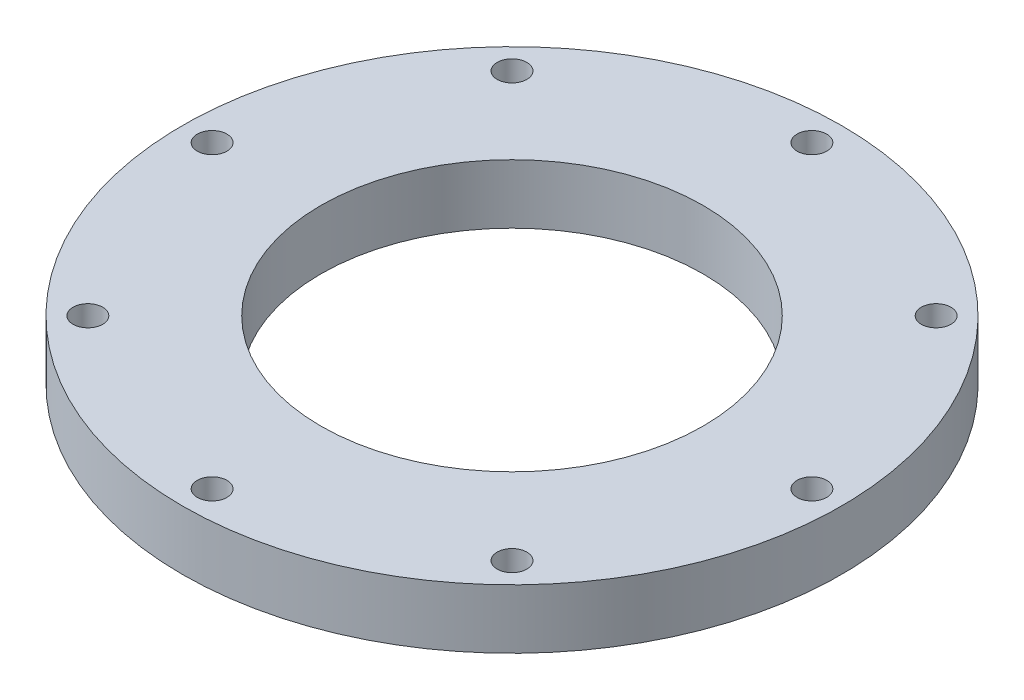
ISO-10303-21;
HEADER;
FILE_DESCRIPTION(('STEP AP214'),'2;1');
FILE_NAME('part.step','',(''),(''),'','','');
FILE_SCHEMA(('AUTOMOTIVE_DESIGN { 1 0 10303 214 1 1 1 1 }'));
ENDSEC;
DATA;
#1=APPLICATION_CONTEXT('core data for automotive mechanical design processes');
#2=APPLICATION_PROTOCOL_DEFINITION('international standard','automotive_design',2000,#1);
#3=PRODUCT_CONTEXT('',#1,'mechanical');
#4=PRODUCT('Part','Part','',(#3));
#5=PRODUCT_RELATED_PRODUCT_CATEGORY('part','',(#4));
#6=PRODUCT_DEFINITION_FORMATION('','',#4);
#7=PRODUCT_DEFINITION_CONTEXT('part definition',#1,'design');
#8=PRODUCT_DEFINITION('design','',#6,#7);
#9=PRODUCT_DEFINITION_SHAPE('','',#8);
#10=(LENGTH_UNIT() NAMED_UNIT(*) SI_UNIT(.MILLI.,.METRE.));
#11=(NAMED_UNIT(*) PLANE_ANGLE_UNIT() SI_UNIT($,.RADIAN.));
#12=(NAMED_UNIT(*) SI_UNIT($,.STERADIAN.) SOLID_ANGLE_UNIT());
#13=UNCERTAINTY_MEASURE_WITH_UNIT(LENGTH_MEASURE(1.E-05),#10,'distance_accuracy_value','');
#14=(GEOMETRIC_REPRESENTATION_CONTEXT(3) GLOBAL_UNCERTAINTY_ASSIGNED_CONTEXT((#13)) GLOBAL_UNIT_ASSIGNED_CONTEXT((#10,
#11,#12)) REPRESENTATION_CONTEXT('',''));
#15=CARTESIAN_POINT('',(0.,0.,0.));
#16=DIRECTION('',(0.,0.,1.));
#17=DIRECTION('',(1.,0.,0.));
#18=AXIS2_PLACEMENT_3D('',#15,#16,#17);
#19=CARTESIAN_POINT('',(0.,4.5,0.));
#20=DIRECTION('',(0.,1.,0.));
#21=DIRECTION('',(0.,0.,1.));
#22=AXIS2_PLACEMENT_3D('',#19,#20,#21);
#23=PLANE('',#22);
#24=CARTESIAN_POINT('',(-32.1733585439875,4.5,-32.1733585439883));
#25=DIRECTION('',(0.,1.,0.));
#26=DIRECTION('',(0.707106781186539,0.,0.707106781186556));
#27=AXIS2_PLACEMENT_3D('',#24,#25,#26);
#28=CIRCLE('',#27,2.25);
#29=CARTESIAN_POINT('',(-30.5823682863178,4.5,-30.5823682863186));
#30=VERTEX_POINT('',#29);
#31=EDGE_CURVE('E92',#30,#30,#28,.T.);
#32=ORIENTED_EDGE('',*,*,#31,.F.);
#33=EDGE_LOOP('',(#32));
#34=FACE_BOUND('',#33,.T.);
#35=CARTESIAN_POINT('',(-45.5,4.5,-4.76587202752088E-13));
#36=DIRECTION('',(0.,1.,0.));
#37=DIRECTION('',(1.,0.,0.));
#38=AXIS2_PLACEMENT_3D('',#35,#36,#37);
#39=CIRCLE('',#38,2.25);
#40=CARTESIAN_POINT('',(-43.25,4.5,-4.53019703714897E-13));
#41=VERTEX_POINT('',#40);
#42=EDGE_CURVE('E86',#41,#41,#39,.T.);
#43=ORIENTED_EDGE('',*,*,#42,.F.);
#44=EDGE_LOOP('',(#43));
#45=FACE_BOUND('',#44,.T.);
#46=CARTESIAN_POINT('',(-32.1733585439882,4.5,32.1733585439876));
#47=DIRECTION('',(0.,1.,0.));
#48=DIRECTION('',(0.707106781186554,0.,-0.707106781186541));
#49=AXIS2_PLACEMENT_3D('',#46,#47,#48);
#50=CIRCLE('',#49,2.25);
#51=CARTESIAN_POINT('',(-30.5823682863184,4.5,30.5823682863179));
#52=VERTEX_POINT('',#51);
#53=EDGE_CURVE('E80',#52,#52,#50,.T.);
#54=ORIENTED_EDGE('',*,*,#53,.F.);
#55=EDGE_LOOP('',(#54));
#56=FACE_BOUND('',#55,.T.);
#57=CARTESIAN_POINT('',(0.,4.5,45.5));
#58=DIRECTION('',(0.,1.,0.));
#59=DIRECTION('',(0.,0.,-1.));
#60=AXIS2_PLACEMENT_3D('',#57,#58,#59);
#61=CIRCLE('',#60,2.25);
#62=CARTESIAN_POINT('',(0.,4.5,43.25));
#63=VERTEX_POINT('',#62);
#64=EDGE_CURVE('E74',#63,#63,#61,.T.);
#65=ORIENTED_EDGE('',*,*,#64,.F.);
#66=EDGE_LOOP('',(#65));
#67=FACE_BOUND('',#66,.T.);
#68=CARTESIAN_POINT('',(32.1733585439877,4.5,32.1733585439881));
#69=DIRECTION('',(0.,1.,0.));
#70=DIRECTION('',(-0.707106781186544,0.,-0.707106781186551));
#71=AXIS2_PLACEMENT_3D('',#68,#69,#70);
#72=CIRCLE('',#71,2.25);
#73=CARTESIAN_POINT('',(30.582368286318,4.5,30.5823682863183));
#74=VERTEX_POINT('',#73);
#75=EDGE_CURVE('E68',#74,#74,#72,.T.);
#76=ORIENTED_EDGE('',*,*,#75,.F.);
#77=EDGE_LOOP('',(#76));
#78=FACE_BOUND('',#77,.T.);
#79=CARTESIAN_POINT('',(45.5,4.5,1.58862400917363E-13));
#80=DIRECTION('',(0.,1.,0.));
#81=DIRECTION('',(-1.,0.,0.));
#82=AXIS2_PLACEMENT_3D('',#79,#80,#81);
#83=CIRCLE('',#82,2.25);
#84=CARTESIAN_POINT('',(43.25,4.5,1.51006567904966E-13));
#85=VERTEX_POINT('',#84);
#86=EDGE_CURVE('E62',#85,#85,#83,.T.);
#87=ORIENTED_EDGE('',*,*,#86,.F.);
#88=EDGE_LOOP('',(#87));
#89=FACE_BOUND('',#88,.T.);
#90=CARTESIAN_POINT('',(32.173358543988,4.5,-32.1733585439879));
#91=DIRECTION('',(0.,1.,0.));
#92=DIRECTION('',(-0.707106781186549,0.,0.707106781186546));
#93=AXIS2_PLACEMENT_3D('',#90,#91,#92);
#94=CIRCLE('',#93,2.25);
#95=CARTESIAN_POINT('',(30.5823682863182,4.5,-30.5823682863181));
#96=VERTEX_POINT('',#95);
#97=EDGE_CURVE('E56',#96,#96,#94,.T.);
#98=ORIENTED_EDGE('',*,*,#97,.F.);
#99=EDGE_LOOP('',(#98));
#100=FACE_BOUND('',#99,.T.);
#101=CARTESIAN_POINT('',(0.,4.5,-45.5));
#102=DIRECTION('',(0.,1.,0.));
#103=DIRECTION('',(0.,0.,1.));
#104=AXIS2_PLACEMENT_3D('',#101,#102,#103);
#105=CIRCLE('',#104,2.25);
#106=CARTESIAN_POINT('',(0.,4.5,-43.25));
#107=VERTEX_POINT('',#106);
#108=EDGE_CURVE('E50',#107,#107,#105,.T.);
#109=ORIENTED_EDGE('',*,*,#108,.F.);
#110=EDGE_LOOP('',(#109));
#111=FACE_BOUND('',#110,.T.);
#112=CARTESIAN_POINT('',(0.,4.5,0.));
#113=DIRECTION('',(0.,1.,0.));
#114=DIRECTION('',(0.,0.,1.));
#115=AXIS2_PLACEMENT_3D('',#112,#113,#114);
#116=CIRCLE('',#115,50.);
#117=CARTESIAN_POINT('',(0.,4.5,50.));
#118=VERTEX_POINT('',#117);
#119=EDGE_CURVE('E10',#118,#118,#116,.T.);
#120=ORIENTED_EDGE('',*,*,#119,.T.);
#121=EDGE_LOOP('',(#120));
#122=FACE_BOUND('',#121,.T.);
#123=CARTESIAN_POINT('',(0.,4.5,0.));
#124=DIRECTION('',(0.,1.,0.));
#125=DIRECTION('',(0.,0.,1.));
#126=AXIS2_PLACEMENT_3D('',#123,#124,#125);
#127=CIRCLE('',#126,29.);
#128=CARTESIAN_POINT('',(0.,4.5,29.));
#129=VERTEX_POINT('',#128);
#130=EDGE_CURVE('E42',#129,#129,#127,.T.);
#131=ORIENTED_EDGE('',*,*,#130,.F.);
#132=EDGE_LOOP('',(#131));
#133=FACE_BOUND('',#132,.T.);
#134=ADVANCED_FACE('F31',(#34,#45,#56,#67,#78,#89,#100,#111,#122,#133),#23,.T.);
#135=CARTESIAN_POINT('',(0.,-4.5,0.));
#136=DIRECTION('',(0.,1.,0.));
#137=DIRECTION('',(0.,0.,1.));
#138=AXIS2_PLACEMENT_3D('',#135,#136,#137);
#139=PLANE('',#138);
#140=CARTESIAN_POINT('',(-32.1733585439875,-4.5,-32.1733585439883));
#141=DIRECTION('',(0.,1.,0.));
#142=DIRECTION('',(0.707106781186539,0.,0.707106781186556));
#143=AXIS2_PLACEMENT_3D('',#140,#141,#142);
#144=CIRCLE('',#143,2.25);
#145=CARTESIAN_POINT('',(-30.5823682863178,-4.5,-30.5823682863186));
#146=VERTEX_POINT('',#145);
#147=EDGE_CURVE('E89',#146,#146,#144,.T.);
#148=ORIENTED_EDGE('',*,*,#147,.T.);
#149=EDGE_LOOP('',(#148));
#150=FACE_BOUND('',#149,.T.);
#151=CARTESIAN_POINT('',(-45.5,-4.5,-4.76587202752088E-13));
#152=DIRECTION('',(0.,1.,0.));
#153=DIRECTION('',(1.,0.,0.));
#154=AXIS2_PLACEMENT_3D('',#151,#152,#153);
#155=CIRCLE('',#154,2.25);
#156=CARTESIAN_POINT('',(-43.25,-4.5,-4.53019703714897E-13));
#157=VERTEX_POINT('',#156);
#158=EDGE_CURVE('E83',#157,#157,#155,.T.);
#159=ORIENTED_EDGE('',*,*,#158,.T.);
#160=EDGE_LOOP('',(#159));
#161=FACE_BOUND('',#160,.T.);
#162=CARTESIAN_POINT('',(-32.1733585439882,-4.5,32.1733585439876));
#163=DIRECTION('',(0.,1.,0.));
#164=DIRECTION('',(0.707106781186554,0.,-0.707106781186541));
#165=AXIS2_PLACEMENT_3D('',#162,#163,#164);
#166=CIRCLE('',#165,2.25);
#167=CARTESIAN_POINT('',(-30.5823682863184,-4.5,30.5823682863179));
#168=VERTEX_POINT('',#167);
#169=EDGE_CURVE('E77',#168,#168,#166,.T.);
#170=ORIENTED_EDGE('',*,*,#169,.T.);
#171=EDGE_LOOP('',(#170));
#172=FACE_BOUND('',#171,.T.);
#173=CARTESIAN_POINT('',(0.,-4.5,45.5));
#174=DIRECTION('',(0.,1.,0.));
#175=DIRECTION('',(0.,0.,-1.));
#176=AXIS2_PLACEMENT_3D('',#173,#174,#175);
#177=CIRCLE('',#176,2.25);
#178=CARTESIAN_POINT('',(0.,-4.5,43.25));
#179=VERTEX_POINT('',#178);
#180=EDGE_CURVE('E71',#179,#179,#177,.T.);
#181=ORIENTED_EDGE('',*,*,#180,.T.);
#182=EDGE_LOOP('',(#181));
#183=FACE_BOUND('',#182,.T.);
#184=CARTESIAN_POINT('',(32.1733585439877,-4.5,32.1733585439881));
#185=DIRECTION('',(0.,1.,0.));
#186=DIRECTION('',(-0.707106781186544,0.,-0.707106781186551));
#187=AXIS2_PLACEMENT_3D('',#184,#185,#186);
#188=CIRCLE('',#187,2.25);
#189=CARTESIAN_POINT('',(30.582368286318,-4.5,30.5823682863183));
#190=VERTEX_POINT('',#189);
#191=EDGE_CURVE('E65',#190,#190,#188,.T.);
#192=ORIENTED_EDGE('',*,*,#191,.T.);
#193=EDGE_LOOP('',(#192));
#194=FACE_BOUND('',#193,.T.);
#195=CARTESIAN_POINT('',(45.5,-4.5,1.58862400917363E-13));
#196=DIRECTION('',(0.,1.,0.));
#197=DIRECTION('',(-1.,0.,0.));
#198=AXIS2_PLACEMENT_3D('',#195,#196,#197);
#199=CIRCLE('',#198,2.25);
#200=CARTESIAN_POINT('',(43.25,-4.5,1.51006567904966E-13));
#201=VERTEX_POINT('',#200);
#202=EDGE_CURVE('E59',#201,#201,#199,.T.);
#203=ORIENTED_EDGE('',*,*,#202,.T.);
#204=EDGE_LOOP('',(#203));
#205=FACE_BOUND('',#204,.T.);
#206=CARTESIAN_POINT('',(32.173358543988,-4.5,-32.1733585439879));
#207=DIRECTION('',(0.,1.,0.));
#208=DIRECTION('',(-0.707106781186549,0.,0.707106781186546));
#209=AXIS2_PLACEMENT_3D('',#206,#207,#208);
#210=CIRCLE('',#209,2.25);
#211=CARTESIAN_POINT('',(30.5823682863182,-4.5,-30.5823682863181));
#212=VERTEX_POINT('',#211);
#213=EDGE_CURVE('E53',#212,#212,#210,.T.);
#214=ORIENTED_EDGE('',*,*,#213,.T.);
#215=EDGE_LOOP('',(#214));
#216=FACE_BOUND('',#215,.T.);
#217=CARTESIAN_POINT('',(0.,-4.5,-45.5));
#218=DIRECTION('',(0.,1.,0.));
#219=DIRECTION('',(0.,0.,1.));
#220=AXIS2_PLACEMENT_3D('',#217,#218,#219);
#221=CIRCLE('',#220,2.25);
#222=CARTESIAN_POINT('',(0.,-4.5,-43.25));
#223=VERTEX_POINT('',#222);
#224=EDGE_CURVE('E47',#223,#223,#221,.T.);
#225=ORIENTED_EDGE('',*,*,#224,.T.);
#226=EDGE_LOOP('',(#225));
#227=FACE_BOUND('',#226,.T.);
#228=CARTESIAN_POINT('',(0.,-4.5,0.));
#229=DIRECTION('',(0.,1.,0.));
#230=DIRECTION('',(0.,0.,1.));
#231=AXIS2_PLACEMENT_3D('',#228,#229,#230);
#232=CIRCLE('',#231,50.);
#233=CARTESIAN_POINT('',(0.,-4.5,50.));
#234=VERTEX_POINT('',#233);
#235=EDGE_CURVE('E35',#234,#234,#232,.T.);
#236=ORIENTED_EDGE('',*,*,#235,.F.);
#237=EDGE_LOOP('',(#236));
#238=FACE_BOUND('',#237,.T.);
#239=CARTESIAN_POINT('',(0.,-4.5,0.));
#240=DIRECTION('',(0.,1.,0.));
#241=DIRECTION('',(0.,0.,1.));
#242=AXIS2_PLACEMENT_3D('',#239,#240,#241);
#243=CIRCLE('',#242,29.);
#244=CARTESIAN_POINT('',(0.,-4.5,29.));
#245=VERTEX_POINT('',#244);
#246=EDGE_CURVE('E44',#245,#245,#243,.T.);
#247=ORIENTED_EDGE('',*,*,#246,.T.);
#248=EDGE_LOOP('',(#247));
#249=FACE_BOUND('',#248,.T.);
#250=ADVANCED_FACE('F98',(#150,#161,#172,#183,#194,#205,#216,#227,#238,#249),#139,.F.);
#251=CARTESIAN_POINT('',(0.,4.5,0.));
#252=DIRECTION('',(0.,-1.,0.));
#253=DIRECTION('',(0.,0.,-1.));
#254=AXIS2_PLACEMENT_3D('',#251,#252,#253);
#255=CYLINDRICAL_SURFACE('',#254,50.);
#256=ORIENTED_EDGE('',*,*,#119,.F.);
#257=EDGE_LOOP('',(#256));
#258=FACE_BOUND('',#257,.T.);
#259=ORIENTED_EDGE('',*,*,#235,.T.);
#260=EDGE_LOOP('',(#259));
#261=FACE_BOUND('',#260,.T.);
#262=ADVANCED_FACE('F33',(#258,#261),#255,.T.);
#263=CARTESIAN_POINT('',(0.,4.5,0.));
#264=DIRECTION('',(0.,-1.,0.));
#265=DIRECTION('',(0.,0.,-1.));
#266=AXIS2_PLACEMENT_3D('',#263,#264,#265);
#267=CYLINDRICAL_SURFACE('',#266,29.);
#268=ORIENTED_EDGE('',*,*,#130,.T.);
#269=EDGE_LOOP('',(#268));
#270=FACE_BOUND('',#269,.T.);
#271=ORIENTED_EDGE('',*,*,#246,.F.);
#272=EDGE_LOOP('',(#271));
#273=FACE_BOUND('',#272,.T.);
#274=ADVANCED_FACE('F127',(#270,#273),#267,.F.);
#275=CARTESIAN_POINT('',(0.,-4.5,-45.5));
#276=DIRECTION('',(0.,1.,0.));
#277=DIRECTION('',(0.,0.,1.));
#278=AXIS2_PLACEMENT_3D('',#275,#276,#277);
#279=CYLINDRICAL_SURFACE('',#278,2.25);
#280=ORIENTED_EDGE('',*,*,#224,.F.);
#281=EDGE_LOOP('',(#280));
#282=FACE_BOUND('',#281,.T.);
#283=ORIENTED_EDGE('',*,*,#108,.T.);
#284=EDGE_LOOP('',(#283));
#285=FACE_BOUND('',#284,.T.);
#286=ADVANCED_FACE('F130',(#282,#285),#279,.F.);
#287=CARTESIAN_POINT('',(32.173358543988,-4.5,-32.1733585439879));
#288=DIRECTION('',(0.,1.,0.));
#289=DIRECTION('',(0.,0.,1.));
#290=AXIS2_PLACEMENT_3D('',#287,#288,#289);
#291=CYLINDRICAL_SURFACE('',#290,2.25);
#292=ORIENTED_EDGE('',*,*,#213,.F.);
#293=EDGE_LOOP('',(#292));
#294=FACE_BOUND('',#293,.T.);
#295=ORIENTED_EDGE('',*,*,#97,.T.);
#296=EDGE_LOOP('',(#295));
#297=FACE_BOUND('',#296,.T.);
#298=ADVANCED_FACE('F142',(#294,#297),#291,.F.);
#299=CARTESIAN_POINT('',(45.5,-4.5,1.58862400917363E-13));
#300=DIRECTION('',(0.,1.,0.));
#301=DIRECTION('',(0.,0.,1.));
#302=AXIS2_PLACEMENT_3D('',#299,#300,#301);
#303=CYLINDRICAL_SURFACE('',#302,2.25);
#304=ORIENTED_EDGE('',*,*,#202,.F.);
#305=EDGE_LOOP('',(#304));
#306=FACE_BOUND('',#305,.T.);
#307=ORIENTED_EDGE('',*,*,#86,.T.);
#308=EDGE_LOOP('',(#307));
#309=FACE_BOUND('',#308,.T.);
#310=ADVANCED_FACE('F146',(#306,#309),#303,.F.);
#311=CARTESIAN_POINT('',(32.1733585439877,-4.5,32.1733585439881));
#312=DIRECTION('',(0.,1.,0.));
#313=DIRECTION('',(0.,0.,1.));
#314=AXIS2_PLACEMENT_3D('',#311,#312,#313);
#315=CYLINDRICAL_SURFACE('',#314,2.25);
#316=ORIENTED_EDGE('',*,*,#191,.F.);
#317=EDGE_LOOP('',(#316));
#318=FACE_BOUND('',#317,.T.);
#319=ORIENTED_EDGE('',*,*,#75,.T.);
#320=EDGE_LOOP('',(#319));
#321=FACE_BOUND('',#320,.T.);
#322=ADVANCED_FACE('F150',(#318,#321),#315,.F.);
#323=CARTESIAN_POINT('',(0.,-4.5,45.5));
#324=DIRECTION('',(0.,1.,0.));
#325=DIRECTION('',(0.,0.,1.));
#326=AXIS2_PLACEMENT_3D('',#323,#324,#325);
#327=CYLINDRICAL_SURFACE('',#326,2.25);
#328=ORIENTED_EDGE('',*,*,#180,.F.);
#329=EDGE_LOOP('',(#328));
#330=FACE_BOUND('',#329,.T.);
#331=ORIENTED_EDGE('',*,*,#64,.T.);
#332=EDGE_LOOP('',(#331));
#333=FACE_BOUND('',#332,.T.);
#334=ADVANCED_FACE('F154',(#330,#333),#327,.F.);
#335=CARTESIAN_POINT('',(-32.1733585439882,-4.5,32.1733585439876));
#336=DIRECTION('',(0.,1.,0.));
#337=DIRECTION('',(0.,0.,1.));
#338=AXIS2_PLACEMENT_3D('',#335,#336,#337);
#339=CYLINDRICAL_SURFACE('',#338,2.25);
#340=ORIENTED_EDGE('',*,*,#169,.F.);
#341=EDGE_LOOP('',(#340));
#342=FACE_BOUND('',#341,.T.);
#343=ORIENTED_EDGE('',*,*,#53,.T.);
#344=EDGE_LOOP('',(#343));
#345=FACE_BOUND('',#344,.T.);
#346=ADVANCED_FACE('F158',(#342,#345),#339,.F.);
#347=CARTESIAN_POINT('',(-45.5,-4.5,-4.76587202752088E-13));
#348=DIRECTION('',(0.,1.,0.));
#349=DIRECTION('',(0.,0.,1.));
#350=AXIS2_PLACEMENT_3D('',#347,#348,#349);
#351=CYLINDRICAL_SURFACE('',#350,2.25);
#352=ORIENTED_EDGE('',*,*,#158,.F.);
#353=EDGE_LOOP('',(#352));
#354=FACE_BOUND('',#353,.T.);
#355=ORIENTED_EDGE('',*,*,#42,.T.);
#356=EDGE_LOOP('',(#355));
#357=FACE_BOUND('',#356,.T.);
#358=ADVANCED_FACE('F104',(#354,#357),#351,.F.);
#359=CARTESIAN_POINT('',(-32.1733585439875,-4.5,-32.1733585439883));
#360=DIRECTION('',(0.,1.,0.));
#361=DIRECTION('',(0.,0.,1.));
#362=AXIS2_PLACEMENT_3D('',#359,#360,#361);
#363=CYLINDRICAL_SURFACE('',#362,2.25);
#364=ORIENTED_EDGE('',*,*,#147,.F.);
#365=EDGE_LOOP('',(#364));
#366=FACE_BOUND('',#365,.T.);
#367=ORIENTED_EDGE('',*,*,#31,.T.);
#368=EDGE_LOOP('',(#367));
#369=FACE_BOUND('',#368,.T.);
#370=ADVANCED_FACE('F101',(#366,#369),#363,.F.);
#371=CLOSED_SHELL('',(#134,#250,#262,#274,#286,#298,#310,#322,#334,#346,#358,#370));
#372=MANIFOLD_SOLID_BREP('B2',#371);
#373=ADVANCED_BREP_SHAPE_REPRESENTATION('',(#18,#372),#14);
#374=SHAPE_DEFINITION_REPRESENTATION(#9,#373);
ENDSEC;
END-ISO-10303-21;
